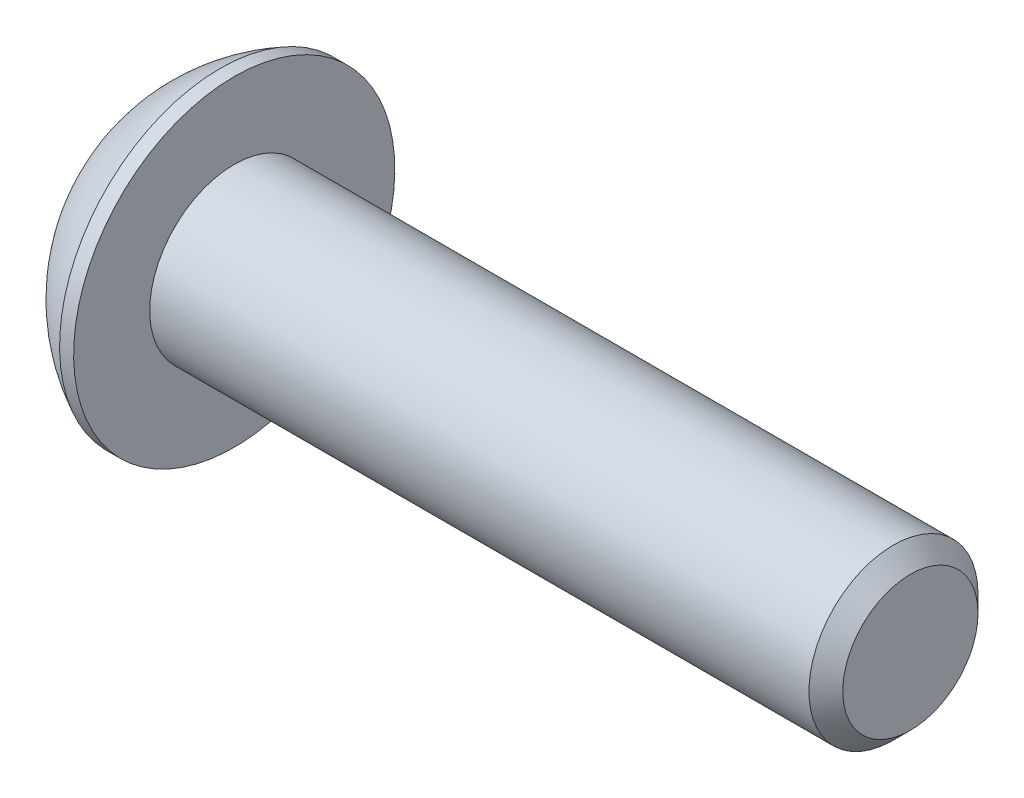
ISO-10303-21;
HEADER;
FILE_DESCRIPTION(('STEP AP214'),'2;1');
FILE_NAME('part.step','',(''),(''),'','','');
FILE_SCHEMA(('AUTOMOTIVE_DESIGN { 1 0 10303 214 1 1 1 1 }'));
ENDSEC;
DATA;
#1=APPLICATION_CONTEXT('core data for automotive mechanical design processes');
#2=APPLICATION_PROTOCOL_DEFINITION('international standard','automotive_design',2000,#1);
#3=PRODUCT_CONTEXT('',#1,'mechanical');
#4=PRODUCT('Part','Part','',(#3));
#5=PRODUCT_RELATED_PRODUCT_CATEGORY('part','',(#4));
#6=PRODUCT_DEFINITION_FORMATION('','',#4);
#7=PRODUCT_DEFINITION_CONTEXT('part definition',#1,'design');
#8=PRODUCT_DEFINITION('design','',#6,#7);
#9=PRODUCT_DEFINITION_SHAPE('','',#8);
#10=(LENGTH_UNIT() NAMED_UNIT(*) SI_UNIT(.MILLI.,.METRE.));
#11=(NAMED_UNIT(*) PLANE_ANGLE_UNIT() SI_UNIT($,.RADIAN.));
#12=(NAMED_UNIT(*) SI_UNIT($,.STERADIAN.) SOLID_ANGLE_UNIT());
#13=UNCERTAINTY_MEASURE_WITH_UNIT(LENGTH_MEASURE(1.E-05),#10,'distance_accuracy_value','');
#14=(GEOMETRIC_REPRESENTATION_CONTEXT(3) GLOBAL_UNCERTAINTY_ASSIGNED_CONTEXT((#13)) GLOBAL_UNIT_ASSIGNED_CONTEXT((#10,
#11,#12)) REPRESENTATION_CONTEXT('',''));
#15=CARTESIAN_POINT('',(0.,0.,0.));
#16=DIRECTION('',(0.,0.,1.));
#17=DIRECTION('',(1.,0.,0.));
#18=AXIS2_PLACEMENT_3D('',#15,#16,#17);
#19=CARTESIAN_POINT('',(-12.,0.,0.));
#20=DIRECTION('',(1.,0.,0.));
#21=DIRECTION('',(0.,0.,-1.));
#22=AXIS2_PLACEMENT_3D('',#19,#20,#21);
#23=CYLINDRICAL_SURFACE('',#22,1.5);
#24=CARTESIAN_POINT('',(-0.300000000000002,0.,0.));
#25=DIRECTION('',(1.,0.,0.));
#26=DIRECTION('',(0.,0.,-1.));
#27=AXIS2_PLACEMENT_3D('',#24,#25,#26);
#28=CIRCLE('',#27,1.5);
#29=CARTESIAN_POINT('',(-0.300000000000002,0.,-1.5));
#30=VERTEX_POINT('',#29);
#31=EDGE_CURVE('E47',#30,#30,#28,.F.);
#32=ORIENTED_EDGE('',*,*,#31,.T.);
#33=EDGE_LOOP('',(#32));
#34=FACE_BOUND('',#33,.T.);
#35=CARTESIAN_POINT('',(-12.,0.,0.));
#36=DIRECTION('',(1.,0.,0.));
#37=DIRECTION('',(0.,1.,0.));
#38=AXIS2_PLACEMENT_3D('',#35,#36,#37);
#39=CIRCLE('',#38,1.5);
#40=CARTESIAN_POINT('',(-12.,1.49999999999999,0.));
#41=VERTEX_POINT('',#40);
#42=EDGE_CURVE('E126',#41,#41,#39,.F.);
#43=ORIENTED_EDGE('',*,*,#42,.F.);
#44=EDGE_LOOP('',(#43));
#45=FACE_BOUND('',#44,.T.);
#46=ADVANCED_FACE('F34',(#34,#45),#23,.T.);
#47=CARTESIAN_POINT('',(0.,0.,0.));
#48=DIRECTION('',(1.,0.,0.));
#49=DIRECTION('',(0.,0.,-1.));
#50=AXIS2_PLACEMENT_3D('',#47,#48,#49);
#51=PLANE('',#50);
#52=CARTESIAN_POINT('',(0.,0.,0.));
#53=DIRECTION('',(1.,0.,0.));
#54=DIRECTION('',(0.,0.,-1.));
#55=AXIS2_PLACEMENT_3D('',#52,#53,#54);
#56=CIRCLE('',#55,1.2);
#57=CARTESIAN_POINT('',(0.,0.,-1.2));
#58=VERTEX_POINT('',#57);
#59=EDGE_CURVE('E129',#58,#58,#56,.T.);
#60=ORIENTED_EDGE('',*,*,#59,.T.);
#61=EDGE_LOOP('',(#60));
#62=FACE_BOUND('',#61,.T.);
#63=ADVANCED_FACE('F139',(#62),#51,.T.);
#64=CARTESIAN_POINT('',(0.,0.,0.));
#65=DIRECTION('',(-1.,0.,0.));
#66=DIRECTION('',(0.,0.,1.));
#67=AXIS2_PLACEMENT_3D('',#64,#65,#66);
#68=CONICAL_SURFACE('',#67,1.2,0.785398163397447);
#69=ORIENTED_EDGE('',*,*,#31,.F.);
#70=EDGE_LOOP('',(#69));
#71=FACE_BOUND('',#70,.T.);
#72=ORIENTED_EDGE('',*,*,#59,.F.);
#73=EDGE_LOOP('',(#72));
#74=FACE_BOUND('',#73,.T.);
#75=ADVANCED_FACE('F36',(#71,#74),#68,.T.);
#76=CARTESIAN_POINT('',(-13.65,0.,0.));
#77=DIRECTION('',(-1.,0.,0.));
#78=DIRECTION('',(0.,-1.,0.));
#79=AXIS2_PLACEMENT_3D('',#76,#77,#78);
#80=PLANE('',#79);
#81=CARTESIAN_POINT('',(-13.65,0.,0.));
#82=DIRECTION('',(-1.,0.,0.));
#83=DIRECTION('',(0.,-1.,0.));
#84=AXIS2_PLACEMENT_3D('',#81,#82,#83);
#85=CIRCLE('',#84,1.20470053837925);
#86=CARTESIAN_POINT('',(-13.65,-1.20470053837926,0.));
#87=VERTEX_POINT('',#86);
#88=EDGE_CURVE('E243',#87,#87,#85,.T.);
#89=ORIENTED_EDGE('',*,*,#88,.F.);
#90=EDGE_LOOP('',(#89));
#91=FACE_BOUND('',#90,.T.);
#92=CARTESIAN_POINT('',(-13.65,0.,0.));
#93=DIRECTION('',(1.,0.,0.));
#94=DIRECTION('',(0.,1.,0.));
#95=AXIS2_PLACEMENT_3D('',#92,#93,#94);
#96=CIRCLE('',#95,1.5);
#97=CARTESIAN_POINT('',(-13.65,1.5,0.));
#98=VERTEX_POINT('',#97);
#99=EDGE_CURVE('E123',#98,#98,#96,.T.);
#100=ORIENTED_EDGE('',*,*,#99,.F.);
#101=EDGE_LOOP('',(#100));
#102=FACE_BOUND('',#101,.T.);
#103=ADVANCED_FACE('F138',(#91,#102),#80,.T.);
#104=CARTESIAN_POINT('',(-10.8526785714286,0.,0.));
#105=DIRECTION('',(1.,0.,0.));
#106=DIRECTION('',(0.,1.,0.));
#107=AXIS2_PLACEMENT_3D('',#104,#105,#106);
#108=SPHERICAL_SURFACE('',#107,3.17411517981703);
#109=ORIENTED_EDGE('',*,*,#99,.T.);
#110=EDGE_LOOP('',(#109));
#111=FACE_BOUND('',#110,.T.);
#112=CARTESIAN_POINT('',(-12.25,0.,0.));
#113=DIRECTION('',(1.,0.,0.));
#114=DIRECTION('',(0.,1.,0.));
#115=AXIS2_PLACEMENT_3D('',#112,#113,#114);
#116=CIRCLE('',#115,2.85);
#117=CARTESIAN_POINT('',(-12.25,2.85,0.));
#118=VERTEX_POINT('',#117);
#119=EDGE_CURVE('E120',#118,#118,#116,.T.);
#120=ORIENTED_EDGE('',*,*,#119,.F.);
#121=EDGE_LOOP('',(#120));
#122=FACE_BOUND('',#121,.T.);
#123=ADVANCED_FACE('F150',(#111,#122),#108,.T.);
#124=CARTESIAN_POINT('',(-12.,0.,0.));
#125=DIRECTION('',(1.,0.,0.));
#126=DIRECTION('',(0.,1.,0.));
#127=AXIS2_PLACEMENT_3D('',#124,#125,#126);
#128=CYLINDRICAL_SURFACE('',#127,2.85);
#129=ORIENTED_EDGE('',*,*,#119,.T.);
#130=EDGE_LOOP('',(#129));
#131=FACE_BOUND('',#130,.T.);
#132=CARTESIAN_POINT('',(-12.,0.,0.));
#133=DIRECTION('',(1.,0.,0.));
#134=DIRECTION('',(0.,1.,0.));
#135=AXIS2_PLACEMENT_3D('',#132,#133,#134);
#136=CIRCLE('',#135,2.85);
#137=CARTESIAN_POINT('',(-12.,2.85,0.));
#138=VERTEX_POINT('',#137);
#139=EDGE_CURVE('E117',#138,#138,#136,.T.);
#140=ORIENTED_EDGE('',*,*,#139,.F.);
#141=EDGE_LOOP('',(#140));
#142=FACE_BOUND('',#141,.T.);
#143=ADVANCED_FACE('F154',(#131,#142),#128,.T.);
#144=CARTESIAN_POINT('',(-12.,2.85,0.));
#145=DIRECTION('',(1.,0.,0.));
#146=DIRECTION('',(0.,1.,0.));
#147=AXIS2_PLACEMENT_3D('',#144,#145,#146);
#148=PLANE('',#147);
#149=ORIENTED_EDGE('',*,*,#42,.T.);
#150=EDGE_LOOP('',(#149));
#151=FACE_BOUND('',#150,.T.);
#152=ORIENTED_EDGE('',*,*,#139,.T.);
#153=EDGE_LOOP('',(#152));
#154=FACE_BOUND('',#153,.T.);
#155=ADVANCED_FACE('F158',(#151,#154),#148,.T.);
#156=CARTESIAN_POINT('',(-13.65,0.,0.));
#157=DIRECTION('',(-1.,0.,0.));
#158=DIRECTION('',(0.,-1.,0.));
#159=AXIS2_PLACEMENT_3D('',#156,#157,#158);
#160=CONICAL_SURFACE('',#159,1.20470053837925,0.78539816339745);
#161=ORIENTED_EDGE('',*,*,#88,.T.);
#162=EDGE_LOOP('',(#161));
#163=FACE_BOUND('',#162,.T.);
#164=CARTESIAN_POINT('',(-14.0125645579163,-1.20678079288097,1.));
#165=CARTESIAN_POINT('',(-13.9901238799752,-1.17763239380938,1.));
#166=CARTESIAN_POINT('',(-13.9678867609271,-1.14832777655039,1.));
#167=CARTESIAN_POINT('',(-13.9239053230859,-1.08934073997341,1.));
#168=CARTESIAN_POINT('',(-13.902161120887,-1.05965823380996,1.));
#169=CARTESIAN_POINT('',(-13.8374858802222,-0.969511619364386,1.));
#170=CARTESIAN_POINT('',(-13.795456442765,-0.908390032886416,1.));
#171=CARTESIAN_POINT('',(-13.7124203349119,-0.77984989921404,1.));
#172=CARTESIAN_POINT('',(-13.6716484956871,-0.712278047733967,1.));
#173=CARTESIAN_POINT('',(-13.5967056855402,-0.573692441836185,1.));
#174=CARTESIAN_POINT('',(-13.5625124208036,-0.502691370033597,1.));
#175=CARTESIAN_POINT('',(-13.5206648240494,-0.396633108483675,1.));
#176=CARTESIAN_POINT('',(-13.5087524246011,-0.363265114723103,1.));
#177=CARTESIAN_POINT('',(-13.4876010580815,-0.295675144863699,1.));
#178=CARTESIAN_POINT('',(-13.4783622608543,-0.261453114661039,1.));
#179=CARTESIAN_POINT('',(-13.4632108375931,-0.192964714439433,1.));
#180=CARTESIAN_POINT('',(-13.4572372079353,-0.158712062702438,1.));
#181=CARTESIAN_POINT('',(-13.4487381792859,-0.0897678989597951,1.));
#182=CARTESIAN_POINT('',(-13.4462131691607,-0.0550763379077967,1.));
#183=CARTESIAN_POINT('',(-13.4448308242394,0.0128534343371955,1.));
#184=CARTESIAN_POINT('',(-13.4458171333425,0.0460884918414608,1.));
#185=CARTESIAN_POINT('',(-13.4510428296463,0.112288777523348,1.));
#186=CARTESIAN_POINT('',(-13.4552814228284,0.145254069576921,1.));
#187=CARTESIAN_POINT('',(-13.4668431932388,0.211252641710467,1.));
#188=CARTESIAN_POINT('',(-13.4742213991969,0.24427612610641,1.));
#189=CARTESIAN_POINT('',(-13.4916537633013,0.3095934161789,1.));
#190=CARTESIAN_POINT('',(-13.5017077720937,0.34188726247213,1.));
#191=CARTESIAN_POINT('',(-13.5364692676108,0.441188556116708,1.));
#192=CARTESIAN_POINT('',(-13.5650343603337,0.50684148084348,1.));
#193=CARTESIAN_POINT('',(-13.6286033694253,0.635081389212367,1.));
#194=CARTESIAN_POINT('',(-13.663629955309,0.697656564069526,1.));
#195=CARTESIAN_POINT('',(-13.7359546107891,0.817274369694615,1.));
#196=CARTESIAN_POINT('',(-13.7730556162911,0.874437672313584,1.));
#197=CARTESIAN_POINT('',(-13.8304371678966,0.958655710303487,1.));
#198=CARTESIAN_POINT('',(-13.8497720189249,0.986366163766953,1.));
#199=CARTESIAN_POINT('',(-13.8889602713879,1.04140691974409,1.));
#200=CARTESIAN_POINT('',(-13.908813529201,1.06873732439881,1.));
#201=CARTESIAN_POINT('',(-13.92888195229,1.0959092145887,1.));
#202=B_SPLINE_CURVE_WITH_KNOTS('',3,(#164,#165,#166,#167,#168,#169,#170,#171,#172,#173,#174,
#175,#176,#177,#178,#179,#180,#181,#182,#183,#184,#185,#186,#187,#188,#189,#190,#191,#192,#193,
#194,#195,#196,#197,#198,#199,#200,#201),.UNSPECIFIED.,.F.,.F.,(4,2,2,2,2,2,2,2,2,2,2,2,2,2,2,2,
2,2,4),(0.,0.110355487284534,0.220736811203826,0.443178348562911,0.679759335181117,
0.915523888816462,1.02172703810024,1.1279369325962,1.23208803653002,1.33625088357217,
1.43583459192535,1.53539399546241,1.63677534642524,1.73815103982916,1.95232008261278,
2.16725532249797,2.37159620059983,2.47295962852456,2.57429526618464),.UNSPECIFIED.);
#203=CARTESIAN_POINT('',(-13.6,-0.577350269189637,1.));
#204=VERTEX_POINT('',#203);
#205=CARTESIAN_POINT('',(-13.6,0.577350269189616,1.));
#206=VERTEX_POINT('',#205);
#207=EDGE_CURVE('E101',#204,#206,#202,.T.);
#208=ORIENTED_EDGE('',*,*,#207,.F.);
#209=CARTESIAN_POINT('',(-13.6001154873726,-1.1548160084331,-0.000200000000000086));
#210=CARTESIAN_POINT('',(-13.5802779308257,-1.13496520795027,0.0341825950071807));
#211=CARTESIAN_POINT('',(-13.5616050206389,-1.11478247255943,0.0691401181398248));
#212=CARTESIAN_POINT('',(-13.5274147427232,-1.0736273952922,0.140422802956089));
#213=CARTESIAN_POINT('',(-13.5119164090235,-1.05265113558081,0.176754750528984));
#214=CARTESIAN_POINT('',(-13.4853673071423,-1.01035337909804,0.250016613803311));
#215=CARTESIAN_POINT('',(-13.4742497739969,-0.989042666109251,0.286927851445414));
#216=CARTESIAN_POINT('',(-13.4571198657762,-0.945952199282702,0.361562729310858));
#217=CARTESIAN_POINT('',(-13.4510946974667,-0.924173762626608,0.399284088108635));
#218=CARTESIAN_POINT('',(-13.4456605549675,-0.886641312640026,0.464292198417932));
#219=CARTESIAN_POINT('',(-13.4448569383167,-0.870936130672287,0.491494371528171));
#220=CARTESIAN_POINT('',(-13.4462066994169,-0.83955617986286,0.545846040669111));
#221=CARTESIAN_POINT('',(-13.4483607295472,-0.823881418494935,0.572995523754874));
#222=CARTESIAN_POINT('',(-13.4591169721285,-0.777080970599378,0.654056277326959));
#223=CARTESIAN_POINT('',(-13.4720145564154,-0.746188191116442,0.707564140978426));
#224=CARTESIAN_POINT('',(-13.5031407306022,-0.691968116419661,0.80147606514343));
#225=CARTESIAN_POINT('',(-13.5197377977018,-0.668386557293383,0.842320523671833));
#226=CARTESIAN_POINT('',(-13.5571249246853,-0.622147085933693,0.922409637381943));
#227=CARTESIAN_POINT('',(-13.5779013418174,-0.599486449584586,0.961659010870437));
#228=CARTESIAN_POINT('',(-13.6001154873726,-0.577234799135799,1.0002));
#229=B_SPLINE_CURVE_WITH_KNOTS('',3,(#209,#210,#211,#212,#213,#214,#215,#216,#217,#218,#219,
#220,#221,#222,#223,#224,#225,#226,#227,#228),.UNSPECIFIED.,.F.,.F.,(4,2,2,2,2,2,2,2,2,4),(0.,
0.133237676828559,0.26725222983449,0.3991370762693,0.530689603280767,0.624814864263845,
0.718960890149131,0.907306626112096,1.05710100361789,1.20641411519286),.UNSPECIFIED.);
#230=CARTESIAN_POINT('',(-13.6,-1.15470053837926,0.));
#231=VERTEX_POINT('',#230);
#232=EDGE_CURVE('E200',#231,#204,#229,.T.);
#233=ORIENTED_EDGE('',*,*,#232,.F.);
#234=CARTESIAN_POINT('',(-13.6001154873726,-0.577234799135799,-1.0002));
#235=CARTESIAN_POINT('',(-13.5802779308257,-0.597085599618632,-0.965817404992819));
#236=CARTESIAN_POINT('',(-13.5616050206389,-0.617268335009467,-0.930859881860175));
#237=CARTESIAN_POINT('',(-13.5274147427232,-0.658423412276697,-0.85957719704391));
#238=CARTESIAN_POINT('',(-13.5119164090235,-0.679399671988091,-0.823245249471016));
#239=CARTESIAN_POINT('',(-13.4853673071423,-0.721697428470857,-0.749983386196689));
#240=CARTESIAN_POINT('',(-13.4742497739969,-0.743008141459647,-0.713072148554586));
#241=CARTESIAN_POINT('',(-13.4571198657762,-0.786098608286197,-0.638437270689141));
#242=CARTESIAN_POINT('',(-13.4510946974667,-0.807877044942291,-0.600715911891365));
#243=CARTESIAN_POINT('',(-13.4456605549675,-0.845409494928873,-0.535707801582067));
#244=CARTESIAN_POINT('',(-13.4448569383167,-0.861114676896612,-0.508505628471829));
#245=CARTESIAN_POINT('',(-13.4462066994169,-0.892494627706039,-0.454153959330889));
#246=CARTESIAN_POINT('',(-13.4483607295472,-0.908169389073964,-0.427004476245125));
#247=CARTESIAN_POINT('',(-13.4591169721285,-0.954969836969521,-0.345943722673041));
#248=CARTESIAN_POINT('',(-13.4720145564154,-0.985862616452458,-0.292435859021573));
#249=CARTESIAN_POINT('',(-13.5031407306022,-1.04008269114924,-0.198523934856569));
#250=CARTESIAN_POINT('',(-13.5197377977018,-1.06366425027552,-0.157679476328167));
#251=CARTESIAN_POINT('',(-13.5571249246853,-1.10990372163521,-0.0775903626180571));
#252=CARTESIAN_POINT('',(-13.5779013418174,-1.13256435798431,-0.0383409891295628));
#253=CARTESIAN_POINT('',(-13.6001154873726,-1.1548160084331,0.00019999999999995));
#254=B_SPLINE_CURVE_WITH_KNOTS('',3,(#234,#235,#236,#237,#238,#239,#240,#241,#242,#243,#244,
#245,#246,#247,#248,#249,#250,#251,#252,#253),.UNSPECIFIED.,.F.,.F.,(4,2,2,2,2,2,2,2,2,4),(0.,
0.133237676828559,0.26725222983449,0.3991370762693,0.530689603280767,0.624814864263845,
0.718960890149132,0.907306626112096,1.05710100361789,1.20641411519286),.UNSPECIFIED.);
#255=CARTESIAN_POINT('',(-13.6,-0.577350269189637,-1.));
#256=VERTEX_POINT('',#255);
#257=EDGE_CURVE('E195',#256,#231,#254,.T.);
#258=ORIENTED_EDGE('',*,*,#257,.F.);
#259=CARTESIAN_POINT('',(-14.0125645579163,-1.20678079288097,-1.));
#260=CARTESIAN_POINT('',(-13.9901238799752,-1.17763239380938,-1.));
#261=CARTESIAN_POINT('',(-13.9678867609271,-1.14832777655039,-1.));
#262=CARTESIAN_POINT('',(-13.9239053230859,-1.08934073997341,-1.));
#263=CARTESIAN_POINT('',(-13.902161120887,-1.05965823380996,-1.));
#264=CARTESIAN_POINT('',(-13.8374858802222,-0.969511619364386,-1.));
#265=CARTESIAN_POINT('',(-13.795456442765,-0.908390032886415,-1.));
#266=CARTESIAN_POINT('',(-13.7124203349119,-0.77984989921404,-1.));
#267=CARTESIAN_POINT('',(-13.6716484956871,-0.712278047733968,-1.));
#268=CARTESIAN_POINT('',(-13.5967056855402,-0.573692441836185,-1.));
#269=CARTESIAN_POINT('',(-13.5625124208036,-0.502691370033597,-1.));
#270=CARTESIAN_POINT('',(-13.5206648240494,-0.396633108483675,-1.));
#271=CARTESIAN_POINT('',(-13.5087524246011,-0.363265114723103,-1.));
#272=CARTESIAN_POINT('',(-13.4876010580815,-0.2956751448637,-1.));
#273=CARTESIAN_POINT('',(-13.4783622608543,-0.261453114661039,-1.));
#274=CARTESIAN_POINT('',(-13.4632108375931,-0.192964714439433,-1.));
#275=CARTESIAN_POINT('',(-13.4572372079353,-0.158712062702438,-1.));
#276=CARTESIAN_POINT('',(-13.4487381792859,-0.0897678989597955,-1.));
#277=CARTESIAN_POINT('',(-13.4462131691607,-0.0550763379077972,-1.));
#278=CARTESIAN_POINT('',(-13.4448308242394,0.012853434337195,-1.));
#279=CARTESIAN_POINT('',(-13.4458171333425,0.0460884918414604,-1.));
#280=CARTESIAN_POINT('',(-13.4510428296463,0.112288777523348,-1.));
#281=CARTESIAN_POINT('',(-13.4552814228284,0.145254069576921,-1.));
#282=CARTESIAN_POINT('',(-13.4668431932388,0.211252641710467,-1.));
#283=CARTESIAN_POINT('',(-13.4742213991969,0.244276126106411,-1.));
#284=CARTESIAN_POINT('',(-13.4916537633013,0.3095934161789,-1.));
#285=CARTESIAN_POINT('',(-13.5017077720937,0.34188726247213,-1.));
#286=CARTESIAN_POINT('',(-13.5364692676108,0.441188556116708,-1.));
#287=CARTESIAN_POINT('',(-13.5650343603337,0.50684148084348,-1.));
#288=CARTESIAN_POINT('',(-13.6286033694253,0.635081389212366,-1.));
#289=CARTESIAN_POINT('',(-13.663629955309,0.697656564069526,-1.));
#290=CARTESIAN_POINT('',(-13.7359546107891,0.817274369694615,-1.));
#291=CARTESIAN_POINT('',(-13.7730556162911,0.874437672313584,-1.));
#292=CARTESIAN_POINT('',(-13.8304371678966,0.958655710303487,-1.));
#293=CARTESIAN_POINT('',(-13.8497720189249,0.986366163766954,-1.));
#294=CARTESIAN_POINT('',(-13.8889602713879,1.04140691974409,-1.));
#295=CARTESIAN_POINT('',(-13.908813529201,1.06873732439881,-1.));
#296=CARTESIAN_POINT('',(-13.92888195229,1.0959092145887,-1.));
#297=B_SPLINE_CURVE_WITH_KNOTS('',3,(#259,#260,#261,#262,#263,#264,#265,#266,#267,#268,#269,
#270,#271,#272,#273,#274,#275,#276,#277,#278,#279,#280,#281,#282,#283,#284,#285,#286,#287,#288,
#289,#290,#291,#292,#293,#294,#295,#296),.UNSPECIFIED.,.F.,.F.,(4,2,2,2,2,2,2,2,2,2,2,2,2,2,2,2,
2,2,4),(0.,0.110355487284534,0.220736811203825,0.443178348562911,0.679759335181115,
0.915523888816463,1.02172703810024,1.1279369325962,1.23208803653002,1.33625088357217,
1.43583459192535,1.53539399546241,1.63677534642524,1.73815103982916,1.95232008261278,
2.16725532249797,2.37159620059983,2.47295962852456,2.57429526618464),.UNSPECIFIED.);
#298=CARTESIAN_POINT('',(-13.6,0.577350269189616,-1.));
#299=VERTEX_POINT('',#298);
#300=EDGE_CURVE('E54',#299,#256,#297,.F.);
#301=ORIENTED_EDGE('',*,*,#300,.F.);
#302=CARTESIAN_POINT('',(-13.6001154873726,1.15481600843308,0.000199999999999967));
#303=CARTESIAN_POINT('',(-13.5802779308257,1.13496520795025,-0.0341825950071809));
#304=CARTESIAN_POINT('',(-13.5616050206389,1.11478247255941,-0.0691401181398252));
#305=CARTESIAN_POINT('',(-13.5274147427232,1.07362739529218,-0.14042280295609));
#306=CARTESIAN_POINT('',(-13.5119164090235,1.05265113558079,-0.176754750528985));
#307=CARTESIAN_POINT('',(-13.4853673071423,1.01035337909802,-0.250016613803312));
#308=CARTESIAN_POINT('',(-13.4742497739969,0.98904266610923,-0.286927851445416));
#309=CARTESIAN_POINT('',(-13.4571198657762,0.94595219928268,-0.361562729310861));
#310=CARTESIAN_POINT('',(-13.4510946974667,0.924173762626585,-0.399284088108638));
#311=CARTESIAN_POINT('',(-13.4456605549675,0.886641312640003,-0.464292198417936));
#312=CARTESIAN_POINT('',(-13.4448569383167,0.870936130672264,-0.491494371528174));
#313=CARTESIAN_POINT('',(-13.4462066994169,0.839556179862837,-0.545846040669114));
#314=CARTESIAN_POINT('',(-13.4483607295472,0.823881418494912,-0.572995523754878));
#315=CARTESIAN_POINT('',(-13.4591169721285,0.777080970599355,-0.654056277326962));
#316=CARTESIAN_POINT('',(-13.4720145564154,0.746188191116419,-0.70756414097843));
#317=CARTESIAN_POINT('',(-13.5031407306022,0.691968116419638,-0.801476065143433));
#318=CARTESIAN_POINT('',(-13.5197377977018,0.66838655729336,-0.842320523671836));
#319=CARTESIAN_POINT('',(-13.5571249246853,0.622147085933671,-0.922409637381944));
#320=CARTESIAN_POINT('',(-13.5779013418174,0.599486449584565,-0.961659010870438));
#321=CARTESIAN_POINT('',(-13.6001154873726,0.577234799135778,-1.0002));
#322=B_SPLINE_CURVE_WITH_KNOTS('',3,(#302,#303,#304,#305,#306,#307,#308,#309,#310,#311,#312,
#313,#314,#315,#316,#317,#318,#319,#320,#321),.UNSPECIFIED.,.F.,.F.,(4,2,2,2,2,2,2,2,2,4),(0.,
0.133237676828559,0.267252229834491,0.399137076269301,0.53068960328077,0.624814864263848,
0.718960890149135,0.9073066261121,1.05710100361789,1.20641411519286),.UNSPECIFIED.);
#323=CARTESIAN_POINT('',(-13.6,1.15470053837924,0.));
#324=VERTEX_POINT('',#323);
#325=EDGE_CURVE('E11',#324,#299,#322,.T.);
#326=ORIENTED_EDGE('',*,*,#325,.F.);
#327=CARTESIAN_POINT('',(-13.6001154873726,0.577234799135778,1.0002));
#328=CARTESIAN_POINT('',(-13.5802779308257,0.597085599618611,0.965817404992819));
#329=CARTESIAN_POINT('',(-13.5616050206389,0.617268335009446,0.930859881860175));
#330=CARTESIAN_POINT('',(-13.5274147427232,0.658423412276675,0.859577197043911));
#331=CARTESIAN_POINT('',(-13.5119164090235,0.679399671988069,0.823245249471017));
#332=CARTESIAN_POINT('',(-13.4853673071423,0.721697428470835,0.74998338619669));
#333=CARTESIAN_POINT('',(-13.4742497739969,0.743008141459626,0.713072148554587));
#334=CARTESIAN_POINT('',(-13.4571198657762,0.786098608286175,0.638437270689142));
#335=CARTESIAN_POINT('',(-13.4510946974667,0.80787704494227,0.600715911891365));
#336=CARTESIAN_POINT('',(-13.4456605549675,0.845409494928852,0.535707801582068));
#337=CARTESIAN_POINT('',(-13.4448569383167,0.861114676896591,0.508505628471829));
#338=CARTESIAN_POINT('',(-13.4462066994169,0.892494627706018,0.454153959330889));
#339=CARTESIAN_POINT('',(-13.4483607295472,0.908169389073943,0.427004476245126));
#340=CARTESIAN_POINT('',(-13.4591169721285,0.9549698369695,0.345943722673041));
#341=CARTESIAN_POINT('',(-13.4720145564154,0.985862616452436,0.292435859021574));
#342=CARTESIAN_POINT('',(-13.5031407306022,1.04008269114922,0.19852393485657));
#343=CARTESIAN_POINT('',(-13.5197377977018,1.06366425027549,0.157679476328167));
#344=CARTESIAN_POINT('',(-13.5571249246853,1.10990372163519,0.0775903626180574));
#345=CARTESIAN_POINT('',(-13.5779013418174,1.13256435798429,0.0383409891295631));
#346=CARTESIAN_POINT('',(-13.6001154873726,1.15481600843308,-0.000199999999999691));
#347=B_SPLINE_CURVE_WITH_KNOTS('',3,(#327,#328,#329,#330,#331,#332,#333,#334,#335,#336,#337,
#338,#339,#340,#341,#342,#343,#344,#345,#346),.UNSPECIFIED.,.F.,.F.,(4,2,2,2,2,2,2,2,2,4),(0.,
0.133237676828558,0.267252229834489,0.399137076269298,0.530689603280766,0.624814864263844,
0.718960890149131,0.907306626112095,1.05710100361789,1.20641411519286),.UNSPECIFIED.);
#348=EDGE_CURVE('E92',#206,#324,#347,.T.);
#349=ORIENTED_EDGE('',*,*,#348,.F.);
#350=EDGE_LOOP('',(#208,#233,#258,#301,#326,#349));
#351=FACE_BOUND('',#350,.T.);
#352=ADVANCED_FACE('F91',(#163,#351),#160,.F.);
#353=CARTESIAN_POINT('',(-12.45,0.,0.));
#354=DIRECTION('',(-1.,0.,0.));
#355=DIRECTION('',(0.,0.,1.));
#356=AXIS2_PLACEMENT_3D('',#353,#354,#355);
#357=PLANE('',#356);
#358=DIRECTION('',(0.,0.5,-0.866025403784439));
#359=VECTOR('',#358,1.);
#360=CARTESIAN_POINT('',(-12.45,0.577350269189616,1.));
#361=LINE('',#360,#359);
#362=CARTESIAN_POINT('',(-12.45,0.577350269189616,1.));
#363=VERTEX_POINT('',#362);
#364=CARTESIAN_POINT('',(-12.45,1.15470053837924,0.));
#365=VERTEX_POINT('',#364);
#366=EDGE_CURVE('E100',#363,#365,#361,.T.);
#367=ORIENTED_EDGE('',*,*,#366,.T.);
#368=DIRECTION('',(0.,-0.5,-0.866025403784439));
#369=VECTOR('',#368,1.);
#370=CARTESIAN_POINT('',(-12.45,1.15470053837924,0.));
#371=LINE('',#370,#369);
#372=CARTESIAN_POINT('',(-12.45,0.577350269189615,-1.));
#373=VERTEX_POINT('',#372);
#374=EDGE_CURVE('E105',#365,#373,#371,.T.);
#375=ORIENTED_EDGE('',*,*,#374,.T.);
#376=DIRECTION('',(0.,-1.,0.));
#377=VECTOR('',#376,1.);
#378=CARTESIAN_POINT('',(-12.45,0.577350269189615,-1.));
#379=LINE('',#378,#377);
#380=CARTESIAN_POINT('',(-12.45,-0.577350269189637,-1.));
#381=VERTEX_POINT('',#380);
#382=EDGE_CURVE('E225',#373,#381,#379,.T.);
#383=ORIENTED_EDGE('',*,*,#382,.T.);
#384=DIRECTION('',(0.,-0.5,0.866025403784439));
#385=VECTOR('',#384,1.);
#386=CARTESIAN_POINT('',(-12.45,-0.577350269189637,-1.));
#387=LINE('',#386,#385);
#388=CARTESIAN_POINT('',(-12.45,-1.15470053837926,0.));
#389=VERTEX_POINT('',#388);
#390=EDGE_CURVE('E229',#381,#389,#387,.T.);
#391=ORIENTED_EDGE('',*,*,#390,.T.);
#392=DIRECTION('',(0.,0.5,0.866025403784439));
#393=VECTOR('',#392,1.);
#394=CARTESIAN_POINT('',(-12.45,-1.15470053837926,0.));
#395=LINE('',#394,#393);
#396=CARTESIAN_POINT('',(-12.45,-0.577350269189637,1.));
#397=VERTEX_POINT('',#396);
#398=EDGE_CURVE('E113',#389,#397,#395,.T.);
#399=ORIENTED_EDGE('',*,*,#398,.T.);
#400=DIRECTION('',(0.,1.,0.));
#401=VECTOR('',#400,1.);
#402=CARTESIAN_POINT('',(-12.45,-0.577350269189637,1.));
#403=LINE('',#402,#401);
#404=EDGE_CURVE('E108',#397,#363,#403,.T.);
#405=ORIENTED_EDGE('',*,*,#404,.T.);
#406=EDGE_LOOP('',(#367,#375,#383,#391,#399,#405));
#407=FACE_BOUND('',#406,.T.);
#408=ADVANCED_FACE('F182',(#407),#357,.T.);
#409=CARTESIAN_POINT('',(-12.45,1.15470053837924,0.));
#410=DIRECTION('',(0.,0.866025403784439,-0.5));
#411=DIRECTION('',(0.,0.5,0.866025403784439));
#412=AXIS2_PLACEMENT_3D('',#409,#410,#411);
#413=PLANE('',#412);
#414=DIRECTION('',(-1.,0.,0.));
#415=VECTOR('',#414,1.);
#416=CARTESIAN_POINT('',(-12.45,1.15470053837924,0.));
#417=LINE('',#416,#415);
#418=EDGE_CURVE('E98',#365,#324,#417,.T.);
#419=ORIENTED_EDGE('',*,*,#418,.T.);
#420=ORIENTED_EDGE('',*,*,#325,.T.);
#421=DIRECTION('',(-1.,0.,0.));
#422=VECTOR('',#421,1.);
#423=CARTESIAN_POINT('',(-12.45,0.577350269189615,-1.));
#424=LINE('',#423,#422);
#425=EDGE_CURVE('E107',#373,#299,#424,.T.);
#426=ORIENTED_EDGE('',*,*,#425,.F.);
#427=ORIENTED_EDGE('',*,*,#374,.F.);
#428=EDGE_LOOP('',(#419,#420,#426,#427));
#429=FACE_BOUND('',#428,.T.);
#430=ADVANCED_FACE('F103',(#429),#413,.F.);
#431=CARTESIAN_POINT('',(-12.45,0.577350269189615,-1.));
#432=DIRECTION('',(0.,0.,-1.));
#433=DIRECTION('',(-1.,0.,0.));
#434=AXIS2_PLACEMENT_3D('',#431,#432,#433);
#435=PLANE('',#434);
#436=ORIENTED_EDGE('',*,*,#425,.T.);
#437=ORIENTED_EDGE('',*,*,#300,.T.);
#438=DIRECTION('',(-1.,0.,0.));
#439=VECTOR('',#438,1.);
#440=CARTESIAN_POINT('',(-12.45,-0.577350269189637,-1.));
#441=LINE('',#440,#439);
#442=EDGE_CURVE('E110',#381,#256,#441,.T.);
#443=ORIENTED_EDGE('',*,*,#442,.F.);
#444=ORIENTED_EDGE('',*,*,#382,.F.);
#445=EDGE_LOOP('',(#436,#437,#443,#444));
#446=FACE_BOUND('',#445,.T.);
#447=ADVANCED_FACE('F214',(#446),#435,.F.);
#448=CARTESIAN_POINT('',(-12.45,-0.577350269189637,-1.));
#449=DIRECTION('',(0.,-0.866025403784439,-0.5));
#450=DIRECTION('',(0.,0.5,-0.866025403784439));
#451=AXIS2_PLACEMENT_3D('',#448,#449,#450);
#452=PLANE('',#451);
#453=ORIENTED_EDGE('',*,*,#442,.T.);
#454=ORIENTED_EDGE('',*,*,#257,.T.);
#455=DIRECTION('',(-1.,0.,0.));
#456=VECTOR('',#455,1.);
#457=CARTESIAN_POINT('',(-12.45,-1.15470053837926,0.));
#458=LINE('',#457,#456);
#459=EDGE_CURVE('E239',#389,#231,#458,.T.);
#460=ORIENTED_EDGE('',*,*,#459,.F.);
#461=ORIENTED_EDGE('',*,*,#390,.F.);
#462=EDGE_LOOP('',(#453,#454,#460,#461));
#463=FACE_BOUND('',#462,.T.);
#464=ADVANCED_FACE('F209',(#463),#452,.F.);
#465=CARTESIAN_POINT('',(-12.45,-1.15470053837926,0.));
#466=DIRECTION('',(0.,-0.866025403784439,0.5));
#467=DIRECTION('',(0.,-0.5,-0.866025403784439));
#468=AXIS2_PLACEMENT_3D('',#465,#466,#467);
#469=PLANE('',#468);
#470=ORIENTED_EDGE('',*,*,#459,.T.);
#471=ORIENTED_EDGE('',*,*,#232,.T.);
#472=DIRECTION('',(-1.,0.,0.));
#473=VECTOR('',#472,1.);
#474=CARTESIAN_POINT('',(-12.45,-0.577350269189637,1.));
#475=LINE('',#474,#473);
#476=EDGE_CURVE('E236',#397,#204,#475,.T.);
#477=ORIENTED_EDGE('',*,*,#476,.F.);
#478=ORIENTED_EDGE('',*,*,#398,.F.);
#479=EDGE_LOOP('',(#470,#471,#477,#478));
#480=FACE_BOUND('',#479,.T.);
#481=ADVANCED_FACE('F206',(#480),#469,.F.);
#482=CARTESIAN_POINT('',(-12.45,-0.577350269189637,1.));
#483=DIRECTION('',(0.,0.,1.));
#484=DIRECTION('',(1.,0.,0.));
#485=AXIS2_PLACEMENT_3D('',#482,#483,#484);
#486=PLANE('',#485);
#487=ORIENTED_EDGE('',*,*,#476,.T.);
#488=ORIENTED_EDGE('',*,*,#207,.T.);
#489=DIRECTION('',(-1.,0.,0.));
#490=VECTOR('',#489,1.);
#491=CARTESIAN_POINT('',(-12.45,0.577350269189616,1.));
#492=LINE('',#491,#490);
#493=EDGE_CURVE('E61',#363,#206,#492,.T.);
#494=ORIENTED_EDGE('',*,*,#493,.F.);
#495=ORIENTED_EDGE('',*,*,#404,.F.);
#496=EDGE_LOOP('',(#487,#488,#494,#495));
#497=FACE_BOUND('',#496,.T.);
#498=ADVANCED_FACE('F165',(#497),#486,.F.);
#499=CARTESIAN_POINT('',(-12.45,0.577350269189616,1.));
#500=DIRECTION('',(0.,0.866025403784439,0.5));
#501=DIRECTION('',(0.,-0.5,0.866025403784439));
#502=AXIS2_PLACEMENT_3D('',#499,#500,#501);
#503=PLANE('',#502);
#504=ORIENTED_EDGE('',*,*,#493,.T.);
#505=ORIENTED_EDGE('',*,*,#348,.T.);
#506=ORIENTED_EDGE('',*,*,#418,.F.);
#507=ORIENTED_EDGE('',*,*,#366,.F.);
#508=EDGE_LOOP('',(#504,#505,#506,#507));
#509=FACE_BOUND('',#508,.T.);
#510=ADVANCED_FACE('F97',(#509),#503,.F.);
#511=CLOSED_SHELL('',(#46,#63,#75,#103,#123,#143,#155,#352,#408,#430,#447,#464,#481,#498,#510));
#512=MANIFOLD_SOLID_BREP('B2',#511);
#513=ADVANCED_BREP_SHAPE_REPRESENTATION('',(#18,#512),#14);
#514=SHAPE_DEFINITION_REPRESENTATION(#9,#513);
ENDSEC;
END-ISO-10303-21;
